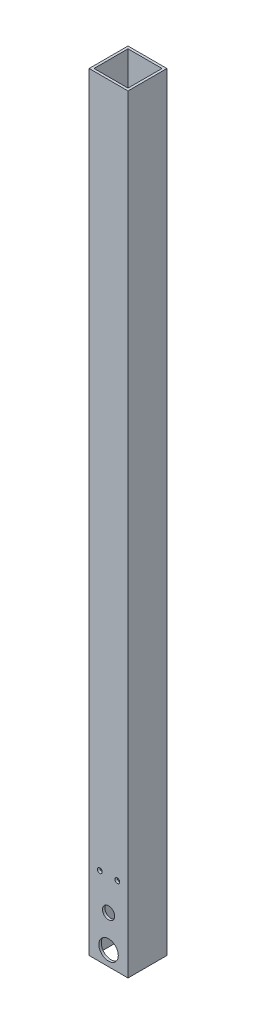
ISO-10303-21;
HEADER;
FILE_DESCRIPTION(('STEP AP214'),'2;1');
FILE_NAME('part.step','',(''),(''),'','','');
FILE_SCHEMA(('AUTOMOTIVE_DESIGN { 1 0 10303 214 1 1 1 1 }'));
ENDSEC;
DATA;
#1=APPLICATION_CONTEXT('core data for automotive mechanical design processes');
#2=APPLICATION_PROTOCOL_DEFINITION('international standard','automotive_design',2000,#1);
#3=PRODUCT_CONTEXT('',#1,'mechanical');
#4=PRODUCT('Part','Part','',(#3));
#5=PRODUCT_RELATED_PRODUCT_CATEGORY('part','',(#4));
#6=PRODUCT_DEFINITION_FORMATION('','',#4);
#7=PRODUCT_DEFINITION_CONTEXT('part definition',#1,'design');
#8=PRODUCT_DEFINITION('design','',#6,#7);
#9=PRODUCT_DEFINITION_SHAPE('','',#8);
#10=(LENGTH_UNIT() NAMED_UNIT(*) SI_UNIT(.MILLI.,.METRE.));
#11=(NAMED_UNIT(*) PLANE_ANGLE_UNIT() SI_UNIT($,.RADIAN.));
#12=(NAMED_UNIT(*) SI_UNIT($,.STERADIAN.) SOLID_ANGLE_UNIT());
#13=UNCERTAINTY_MEASURE_WITH_UNIT(LENGTH_MEASURE(1.E-05),#10,'distance_accuracy_value','');
#14=(GEOMETRIC_REPRESENTATION_CONTEXT(3) GLOBAL_UNCERTAINTY_ASSIGNED_CONTEXT((#13)) GLOBAL_UNIT_ASSIGNED_CONTEXT((#10,
#11,#12)) REPRESENTATION_CONTEXT('',''));
#15=CARTESIAN_POINT('',(0.,0.,0.));
#16=DIRECTION('',(0.,0.,1.));
#17=DIRECTION('',(1.,0.,0.));
#18=AXIS2_PLACEMENT_3D('',#15,#16,#17);
#19=CARTESIAN_POINT('',(0.,501.65,0.));
#20=DIRECTION('',(0.,1.,0.));
#21=DIRECTION('',(0.,0.,1.));
#22=AXIS2_PLACEMENT_3D('',#19,#20,#21);
#23=PLANE('',#22);
#24=DIRECTION('',(0.,0.,-1.));
#25=VECTOR('',#24,1.);
#26=CARTESIAN_POINT('',(12.7,501.65,-12.7));
#27=LINE('',#26,#25);
#28=CARTESIAN_POINT('',(12.7,501.65,12.7));
#29=VERTEX_POINT('',#28);
#30=CARTESIAN_POINT('',(12.7,501.65,-12.7));
#31=VERTEX_POINT('',#30);
#32=EDGE_CURVE('E138',#29,#31,#27,.T.);
#33=ORIENTED_EDGE('',*,*,#32,.T.);
#34=DIRECTION('',(-1.,0.,0.));
#35=VECTOR('',#34,1.);
#36=CARTESIAN_POINT('',(-12.7,501.65,-12.7));
#37=LINE('',#36,#35);
#38=CARTESIAN_POINT('',(-12.7,501.65,-12.7));
#39=VERTEX_POINT('',#38);
#40=EDGE_CURVE('E141',#31,#39,#37,.T.);
#41=ORIENTED_EDGE('',*,*,#40,.T.);
#42=DIRECTION('',(0.,0.,1.));
#43=VECTOR('',#42,1.);
#44=CARTESIAN_POINT('',(-12.7,501.65,-12.7));
#45=LINE('',#44,#43);
#46=CARTESIAN_POINT('',(-12.7,501.65,12.7));
#47=VERTEX_POINT('',#46);
#48=EDGE_CURVE('E144',#39,#47,#45,.T.);
#49=ORIENTED_EDGE('',*,*,#48,.T.);
#50=DIRECTION('',(1.,0.,0.));
#51=VECTOR('',#50,1.);
#52=CARTESIAN_POINT('',(-12.7,501.65,12.7));
#53=LINE('',#52,#51);
#54=EDGE_CURVE('E146',#47,#29,#53,.T.);
#55=ORIENTED_EDGE('',*,*,#54,.T.);
#56=EDGE_LOOP('',(#33,#41,#49,#55));
#57=FACE_BOUND('',#56,.T.);
#58=DIRECTION('',(0.,0.,1.));
#59=VECTOR('',#58,1.);
#60=CARTESIAN_POINT('',(-11.1125,501.65,-11.1125));
#61=LINE('',#60,#59);
#62=CARTESIAN_POINT('',(-11.1125,501.65,-11.1125));
#63=VERTEX_POINT('',#62);
#64=CARTESIAN_POINT('',(-11.1125,501.65,11.1125));
#65=VERTEX_POINT('',#64);
#66=EDGE_CURVE('E108',#63,#65,#61,.T.);
#67=ORIENTED_EDGE('',*,*,#66,.F.);
#68=DIRECTION('',(-1.,0.,0.));
#69=VECTOR('',#68,1.);
#70=CARTESIAN_POINT('',(-11.1125,501.65,-11.1125));
#71=LINE('',#70,#69);
#72=CARTESIAN_POINT('',(11.1125,501.65,-11.1125));
#73=VERTEX_POINT('',#72);
#74=EDGE_CURVE('E100',#73,#63,#71,.T.);
#75=ORIENTED_EDGE('',*,*,#74,.F.);
#76=DIRECTION('',(0.,0.,-1.));
#77=VECTOR('',#76,1.);
#78=CARTESIAN_POINT('',(11.1125,501.65,-11.1125));
#79=LINE('',#78,#77);
#80=CARTESIAN_POINT('',(11.1125,501.65,11.1125));
#81=VERTEX_POINT('',#80);
#82=EDGE_CURVE('E122',#81,#73,#79,.T.);
#83=ORIENTED_EDGE('',*,*,#82,.F.);
#84=DIRECTION('',(1.,0.,0.));
#85=VECTOR('',#84,1.);
#86=CARTESIAN_POINT('',(-11.1125,501.65,11.1125));
#87=LINE('',#86,#85);
#88=EDGE_CURVE('E120',#65,#81,#87,.T.);
#89=ORIENTED_EDGE('',*,*,#88,.F.);
#90=EDGE_LOOP('',(#67,#75,#83,#89));
#91=FACE_BOUND('',#90,.T.);
#92=ADVANCED_FACE('F33',(#57,#91),#23,.T.);
#93=CARTESIAN_POINT('',(0.,0.,0.));
#94=DIRECTION('',(0.,1.,0.));
#95=DIRECTION('',(0.,0.,1.));
#96=AXIS2_PLACEMENT_3D('',#93,#94,#95);
#97=PLANE('',#96);
#98=DIRECTION('',(0.,0.,-1.));
#99=VECTOR('',#98,1.);
#100=CARTESIAN_POINT('',(12.7,0.,-12.7));
#101=LINE('',#100,#99);
#102=CARTESIAN_POINT('',(12.7,0.,12.7));
#103=VERTEX_POINT('',#102);
#104=CARTESIAN_POINT('',(12.7,0.,-12.7));
#105=VERTEX_POINT('',#104);
#106=EDGE_CURVE('E116',#103,#105,#101,.T.);
#107=ORIENTED_EDGE('',*,*,#106,.F.);
#108=DIRECTION('',(1.,0.,0.));
#109=VECTOR('',#108,1.);
#110=CARTESIAN_POINT('',(-12.7,0.,12.7));
#111=LINE('',#110,#109);
#112=CARTESIAN_POINT('',(-12.7,0.,12.7));
#113=VERTEX_POINT('',#112);
#114=EDGE_CURVE('E142',#113,#103,#111,.T.);
#115=ORIENTED_EDGE('',*,*,#114,.F.);
#116=DIRECTION('',(0.,0.,1.));
#117=VECTOR('',#116,1.);
#118=CARTESIAN_POINT('',(-12.7,0.,-12.7));
#119=LINE('',#118,#117);
#120=CARTESIAN_POINT('',(-12.7,0.,-12.7));
#121=VERTEX_POINT('',#120);
#122=EDGE_CURVE('E153',#121,#113,#119,.T.);
#123=ORIENTED_EDGE('',*,*,#122,.F.);
#124=DIRECTION('',(-1.,0.,0.));
#125=VECTOR('',#124,1.);
#126=CARTESIAN_POINT('',(-12.7,0.,-12.7));
#127=LINE('',#126,#125);
#128=EDGE_CURVE('E151',#105,#121,#127,.T.);
#129=ORIENTED_EDGE('',*,*,#128,.F.);
#130=EDGE_LOOP('',(#107,#115,#123,#129));
#131=FACE_BOUND('',#130,.T.);
#132=DIRECTION('',(-1.,0.,0.));
#133=VECTOR('',#132,1.);
#134=CARTESIAN_POINT('',(-11.1125,0.,-11.1125));
#135=LINE('',#134,#133);
#136=CARTESIAN_POINT('',(11.1125,0.,-11.1125));
#137=VERTEX_POINT('',#136);
#138=CARTESIAN_POINT('',(-11.1125,0.,-11.1125));
#139=VERTEX_POINT('',#138);
#140=EDGE_CURVE('E58',#137,#139,#135,.T.);
#141=ORIENTED_EDGE('',*,*,#140,.T.);
#142=DIRECTION('',(0.,0.,1.));
#143=VECTOR('',#142,1.);
#144=CARTESIAN_POINT('',(-11.1125,0.,-11.1125));
#145=LINE('',#144,#143);
#146=CARTESIAN_POINT('',(-11.1125,0.,11.1125));
#147=VERTEX_POINT('',#146);
#148=EDGE_CURVE('E115',#139,#147,#145,.T.);
#149=ORIENTED_EDGE('',*,*,#148,.T.);
#150=DIRECTION('',(1.,0.,0.));
#151=VECTOR('',#150,1.);
#152=CARTESIAN_POINT('',(-11.1125,0.,11.1125));
#153=LINE('',#152,#151);
#154=CARTESIAN_POINT('',(11.1125,0.,11.1125));
#155=VERTEX_POINT('',#154);
#156=EDGE_CURVE('E130',#147,#155,#153,.T.);
#157=ORIENTED_EDGE('',*,*,#156,.T.);
#158=DIRECTION('',(0.,0.,-1.));
#159=VECTOR('',#158,1.);
#160=CARTESIAN_POINT('',(11.1125,0.,-11.1125));
#161=LINE('',#160,#159);
#162=EDGE_CURVE('E109',#155,#137,#161,.T.);
#163=ORIENTED_EDGE('',*,*,#162,.T.);
#164=EDGE_LOOP('',(#141,#149,#157,#163));
#165=FACE_BOUND('',#164,.T.);
#166=ADVANCED_FACE('F221',(#131,#165),#97,.F.);
#167=CARTESIAN_POINT('',(12.7,501.65,-12.7));
#168=DIRECTION('',(-1.,0.,0.));
#169=DIRECTION('',(0.,0.,1.));
#170=AXIS2_PLACEMENT_3D('',#167,#168,#169);
#171=PLANE('',#170);
#172=ORIENTED_EDGE('',*,*,#106,.T.);
#173=DIRECTION('',(0.,-1.,0.));
#174=VECTOR('',#173,1.);
#175=CARTESIAN_POINT('',(12.7,501.65,-12.7));
#176=LINE('',#175,#174);
#177=EDGE_CURVE('E11',#31,#105,#176,.T.);
#178=ORIENTED_EDGE('',*,*,#177,.F.);
#179=ORIENTED_EDGE('',*,*,#32,.F.);
#180=DIRECTION('',(0.,-1.,0.));
#181=VECTOR('',#180,1.);
#182=CARTESIAN_POINT('',(12.7,501.65,12.7));
#183=LINE('',#182,#181);
#184=EDGE_CURVE('E148',#29,#103,#183,.T.);
#185=ORIENTED_EDGE('',*,*,#184,.T.);
#186=EDGE_LOOP('',(#172,#178,#179,#185));
#187=FACE_BOUND('',#186,.T.);
#188=ADVANCED_FACE('F35',(#187),#171,.F.);
#189=CARTESIAN_POINT('',(-12.7,501.65,-12.7));
#190=DIRECTION('',(0.,0.,1.));
#191=DIRECTION('',(1.,0.,0.));
#192=AXIS2_PLACEMENT_3D('',#189,#190,#191);
#193=PLANE('',#192);
#194=CARTESIAN_POINT('',(5.70963749660649,51.517813991833,-12.7));
#195=DIRECTION('',(0.,0.,-1.));
#196=DIRECTION('',(-1.,0.,0.));
#197=AXIS2_PLACEMENT_3D('',#194,#195,#196);
#198=CIRCLE('',#197,1.5875);
#199=CARTESIAN_POINT('',(4.12213749660649,51.517813991833,-12.7));
#200=VERTEX_POINT('',#199);
#201=EDGE_CURVE('E175',#200,#200,#198,.T.);
#202=ORIENTED_EDGE('',*,*,#201,.F.);
#203=EDGE_LOOP('',(#202));
#204=FACE_BOUND('',#203,.T.);
#205=CARTESIAN_POINT('',(-5.70963749660667,51.517813991833,-12.7));
#206=DIRECTION('',(0.,0.,-1.));
#207=DIRECTION('',(-1.,0.,0.));
#208=AXIS2_PLACEMENT_3D('',#205,#206,#207);
#209=CIRCLE('',#208,1.5875);
#210=CARTESIAN_POINT('',(-7.29713749660667,51.517813991833,-12.7));
#211=VERTEX_POINT('',#210);
#212=EDGE_CURVE('E188',#211,#211,#209,.T.);
#213=ORIENTED_EDGE('',*,*,#212,.F.);
#214=EDGE_LOOP('',(#213));
#215=FACE_BOUND('',#214,.T.);
#216=CARTESIAN_POINT('',(0.,9.525,-12.7));
#217=DIRECTION('',(0.,0.,1.));
#218=DIRECTION('',(1.,0.,0.));
#219=AXIS2_PLACEMENT_3D('',#216,#217,#218);
#220=CIRCLE('',#219,6.35);
#221=CARTESIAN_POINT('',(6.35,9.525,-12.7));
#222=VERTEX_POINT('',#221);
#223=EDGE_CURVE('E165',#222,#222,#220,.T.);
#224=ORIENTED_EDGE('',*,*,#223,.T.);
#225=EDGE_LOOP('',(#224));
#226=FACE_BOUND('',#225,.T.);
#227=ORIENTED_EDGE('',*,*,#128,.T.);
#228=DIRECTION('',(0.,-1.,0.));
#229=VECTOR('',#228,1.);
#230=CARTESIAN_POINT('',(-12.7,501.65,-12.7));
#231=LINE('',#230,#229);
#232=EDGE_CURVE('E42',#39,#121,#231,.T.);
#233=ORIENTED_EDGE('',*,*,#232,.F.);
#234=ORIENTED_EDGE('',*,*,#40,.F.);
#235=ORIENTED_EDGE('',*,*,#177,.T.);
#236=EDGE_LOOP('',(#227,#233,#234,#235));
#237=FACE_BOUND('',#236,.T.);
#238=ADVANCED_FACE('F230',(#204,#215,#226,#237),#193,.F.);
#239=CARTESIAN_POINT('',(-12.7,501.65,-12.7));
#240=DIRECTION('',(1.,0.,0.));
#241=DIRECTION('',(0.,0.,-1.));
#242=AXIS2_PLACEMENT_3D('',#239,#240,#241);
#243=PLANE('',#242);
#244=ORIENTED_EDGE('',*,*,#122,.T.);
#245=DIRECTION('',(0.,-1.,0.));
#246=VECTOR('',#245,1.);
#247=CARTESIAN_POINT('',(-12.7,501.65,12.7));
#248=LINE('',#247,#246);
#249=EDGE_CURVE('E158',#47,#113,#248,.T.);
#250=ORIENTED_EDGE('',*,*,#249,.F.);
#251=ORIENTED_EDGE('',*,*,#48,.F.);
#252=ORIENTED_EDGE('',*,*,#232,.T.);
#253=EDGE_LOOP('',(#244,#250,#251,#252));
#254=FACE_BOUND('',#253,.T.);
#255=ADVANCED_FACE('F214',(#254),#243,.F.);
#256=CARTESIAN_POINT('',(-12.7,501.65,12.7));
#257=DIRECTION('',(0.,0.,-1.));
#258=DIRECTION('',(-1.,0.,0.));
#259=AXIS2_PLACEMENT_3D('',#256,#257,#258);
#260=PLANE('',#259);
#261=CARTESIAN_POINT('',(0.,30.5023011999998,12.7));
#262=DIRECTION('',(0.,0.,1.));
#263=DIRECTION('',(1.,0.,0.));
#264=AXIS2_PLACEMENT_3D('',#261,#262,#263);
#265=CIRCLE('',#264,3.96875000000002);
#266=CARTESIAN_POINT('',(3.96875000000002,30.5023011999998,12.7));
#267=VERTEX_POINT('',#266);
#268=EDGE_CURVE('E289',#267,#267,#265,.T.);
#269=ORIENTED_EDGE('',*,*,#268,.F.);
#270=EDGE_LOOP('',(#269));
#271=FACE_BOUND('',#270,.T.);
#272=CARTESIAN_POINT('',(5.70963749660649,51.517813991833,12.7));
#273=DIRECTION('',(0.,0.,-1.));
#274=DIRECTION('',(-1.,0.,0.));
#275=AXIS2_PLACEMENT_3D('',#272,#273,#274);
#276=CIRCLE('',#275,1.5875);
#277=CARTESIAN_POINT('',(4.12213749660649,51.517813991833,12.7));
#278=VERTEX_POINT('',#277);
#279=EDGE_CURVE('E169',#278,#278,#276,.T.);
#280=ORIENTED_EDGE('',*,*,#279,.T.);
#281=EDGE_LOOP('',(#280));
#282=FACE_BOUND('',#281,.T.);
#283=CARTESIAN_POINT('',(-5.70963749660667,51.517813991833,12.7));
#284=DIRECTION('',(0.,0.,-1.));
#285=DIRECTION('',(-1.,0.,0.));
#286=AXIS2_PLACEMENT_3D('',#283,#284,#285);
#287=CIRCLE('',#286,1.5875);
#288=CARTESIAN_POINT('',(-7.29713749660667,51.517813991833,12.7));
#289=VERTEX_POINT('',#288);
#290=EDGE_CURVE('E180',#289,#289,#287,.T.);
#291=ORIENTED_EDGE('',*,*,#290,.T.);
#292=EDGE_LOOP('',(#291));
#293=FACE_BOUND('',#292,.T.);
#294=CARTESIAN_POINT('',(0.,9.525,12.7));
#295=DIRECTION('',(0.,0.,1.));
#296=DIRECTION('',(1.,0.,0.));
#297=AXIS2_PLACEMENT_3D('',#294,#295,#296);
#298=CIRCLE('',#297,6.35);
#299=CARTESIAN_POINT('',(6.35,9.525,12.7));
#300=VERTEX_POINT('',#299);
#301=EDGE_CURVE('E194',#300,#300,#298,.T.);
#302=ORIENTED_EDGE('',*,*,#301,.F.);
#303=EDGE_LOOP('',(#302));
#304=FACE_BOUND('',#303,.T.);
#305=ORIENTED_EDGE('',*,*,#114,.T.);
#306=ORIENTED_EDGE('',*,*,#184,.F.);
#307=ORIENTED_EDGE('',*,*,#54,.F.);
#308=ORIENTED_EDGE('',*,*,#249,.T.);
#309=EDGE_LOOP('',(#305,#306,#307,#308));
#310=FACE_BOUND('',#309,.T.);
#311=ADVANCED_FACE('F205',(#271,#282,#293,#304,#310),#260,.F.);
#312=CARTESIAN_POINT('',(-11.1125,501.65,-11.1125));
#313=DIRECTION('',(0.,0.,1.));
#314=DIRECTION('',(1.,0.,0.));
#315=AXIS2_PLACEMENT_3D('',#312,#313,#314);
#316=PLANE('',#315);
#317=CARTESIAN_POINT('',(5.70963749660649,51.517813991833,-11.1125));
#318=DIRECTION('',(0.,0.,1.));
#319=DIRECTION('',(1.,0.,0.));
#320=AXIS2_PLACEMENT_3D('',#317,#318,#319);
#321=CIRCLE('',#320,1.5875);
#322=CARTESIAN_POINT('',(7.29713749660649,51.517813991833,-11.1125));
#323=VERTEX_POINT('',#322);
#324=EDGE_CURVE('E191',#323,#323,#321,.T.);
#325=ORIENTED_EDGE('',*,*,#324,.F.);
#326=EDGE_LOOP('',(#325));
#327=FACE_BOUND('',#326,.T.);
#328=CARTESIAN_POINT('',(-5.70963749660667,51.517813991833,-11.1125));
#329=DIRECTION('',(0.,0.,1.));
#330=DIRECTION('',(1.,0.,0.));
#331=AXIS2_PLACEMENT_3D('',#328,#329,#330);
#332=CIRCLE('',#331,1.5875);
#333=CARTESIAN_POINT('',(-4.12213749660667,51.517813991833,-11.1125));
#334=VERTEX_POINT('',#333);
#335=EDGE_CURVE('E168',#334,#334,#332,.T.);
#336=ORIENTED_EDGE('',*,*,#335,.F.);
#337=EDGE_LOOP('',(#336));
#338=FACE_BOUND('',#337,.T.);
#339=CARTESIAN_POINT('',(0.,9.525,-11.1125));
#340=DIRECTION('',(0.,0.,1.));
#341=DIRECTION('',(1.,0.,0.));
#342=AXIS2_PLACEMENT_3D('',#339,#340,#341);
#343=CIRCLE('',#342,6.35);
#344=CARTESIAN_POINT('',(6.35,9.525,-11.1125));
#345=VERTEX_POINT('',#344);
#346=EDGE_CURVE('E128',#345,#345,#343,.T.);
#347=ORIENTED_EDGE('',*,*,#346,.F.);
#348=EDGE_LOOP('',(#347));
#349=FACE_BOUND('',#348,.T.);
#350=ORIENTED_EDGE('',*,*,#140,.F.);
#351=DIRECTION('',(0.,-1.,0.));
#352=VECTOR('',#351,1.);
#353=CARTESIAN_POINT('',(11.1125,501.65,-11.1125));
#354=LINE('',#353,#352);
#355=EDGE_CURVE('E104',#73,#137,#354,.T.);
#356=ORIENTED_EDGE('',*,*,#355,.F.);
#357=ORIENTED_EDGE('',*,*,#74,.T.);
#358=DIRECTION('',(0.,-1.,0.));
#359=VECTOR('',#358,1.);
#360=CARTESIAN_POINT('',(-11.1125,501.65,-11.1125));
#361=LINE('',#360,#359);
#362=EDGE_CURVE('E103',#63,#139,#361,.T.);
#363=ORIENTED_EDGE('',*,*,#362,.T.);
#364=EDGE_LOOP('',(#350,#356,#357,#363));
#365=FACE_BOUND('',#364,.T.);
#366=ADVANCED_FACE('F102',(#327,#338,#349,#365),#316,.T.);
#367=CARTESIAN_POINT('',(-11.1125,501.65,-11.1125));
#368=DIRECTION('',(1.,0.,0.));
#369=DIRECTION('',(0.,0.,-1.));
#370=AXIS2_PLACEMENT_3D('',#367,#368,#369);
#371=PLANE('',#370);
#372=ORIENTED_EDGE('',*,*,#148,.F.);
#373=ORIENTED_EDGE('',*,*,#362,.F.);
#374=ORIENTED_EDGE('',*,*,#66,.T.);
#375=DIRECTION('',(0.,-1.,0.));
#376=VECTOR('',#375,1.);
#377=CARTESIAN_POINT('',(-11.1125,501.65,11.1125));
#378=LINE('',#377,#376);
#379=EDGE_CURVE('E117',#65,#147,#378,.T.);
#380=ORIENTED_EDGE('',*,*,#379,.T.);
#381=EDGE_LOOP('',(#372,#373,#374,#380));
#382=FACE_BOUND('',#381,.T.);
#383=ADVANCED_FACE('F112',(#382),#371,.T.);
#384=CARTESIAN_POINT('',(-11.1125,501.65,11.1125));
#385=DIRECTION('',(0.,0.,-1.));
#386=DIRECTION('',(-1.,0.,0.));
#387=AXIS2_PLACEMENT_3D('',#384,#385,#386);
#388=PLANE('',#387);
#389=CARTESIAN_POINT('',(0.,30.5023011999998,11.1125));
#390=DIRECTION('',(0.,0.,-1.));
#391=DIRECTION('',(-1.,0.,0.));
#392=AXIS2_PLACEMENT_3D('',#389,#390,#391);
#393=CIRCLE('',#392,3.96875000000002);
#394=CARTESIAN_POINT('',(-3.96875000000002,30.5023011999998,11.1125));
#395=VERTEX_POINT('',#394);
#396=EDGE_CURVE('E183',#395,#395,#393,.F.);
#397=ORIENTED_EDGE('',*,*,#396,.T.);
#398=EDGE_LOOP('',(#397));
#399=FACE_BOUND('',#398,.T.);
#400=CARTESIAN_POINT('',(5.70963749660649,51.517813991833,11.1125));
#401=DIRECTION('',(0.,0.,-1.));
#402=DIRECTION('',(-1.,0.,0.));
#403=AXIS2_PLACEMENT_3D('',#400,#401,#402);
#404=CIRCLE('',#403,1.5875);
#405=CARTESIAN_POINT('',(4.12213749660649,51.517813991833,11.1125));
#406=VERTEX_POINT('',#405);
#407=EDGE_CURVE('E37',#406,#406,#404,.T.);
#408=ORIENTED_EDGE('',*,*,#407,.F.);
#409=EDGE_LOOP('',(#408));
#410=FACE_BOUND('',#409,.T.);
#411=CARTESIAN_POINT('',(-5.70963749660667,51.517813991833,11.1125));
#412=DIRECTION('',(0.,0.,-1.));
#413=DIRECTION('',(-1.,0.,0.));
#414=AXIS2_PLACEMENT_3D('',#411,#412,#413);
#415=CIRCLE('',#414,1.5875);
#416=CARTESIAN_POINT('',(-7.29713749660667,51.517813991833,11.1125));
#417=VERTEX_POINT('',#416);
#418=EDGE_CURVE('E166',#417,#417,#415,.T.);
#419=ORIENTED_EDGE('',*,*,#418,.F.);
#420=EDGE_LOOP('',(#419));
#421=FACE_BOUND('',#420,.T.);
#422=CARTESIAN_POINT('',(0.,9.525,11.1125));
#423=DIRECTION('',(0.,0.,-1.));
#424=DIRECTION('',(-1.,0.,0.));
#425=AXIS2_PLACEMENT_3D('',#422,#423,#424);
#426=CIRCLE('',#425,6.35);
#427=CARTESIAN_POINT('',(-6.35,9.525,11.1125));
#428=VERTEX_POINT('',#427);
#429=EDGE_CURVE('E163',#428,#428,#426,.T.);
#430=ORIENTED_EDGE('',*,*,#429,.F.);
#431=EDGE_LOOP('',(#430));
#432=FACE_BOUND('',#431,.T.);
#433=ORIENTED_EDGE('',*,*,#156,.F.);
#434=ORIENTED_EDGE('',*,*,#379,.F.);
#435=ORIENTED_EDGE('',*,*,#88,.T.);
#436=DIRECTION('',(0.,-1.,0.));
#437=VECTOR('',#436,1.);
#438=CARTESIAN_POINT('',(11.1125,501.65,11.1125));
#439=LINE('',#438,#437);
#440=EDGE_CURVE('E50',#81,#155,#439,.T.);
#441=ORIENTED_EDGE('',*,*,#440,.T.);
#442=EDGE_LOOP('',(#433,#434,#435,#441));
#443=FACE_BOUND('',#442,.T.);
#444=ADVANCED_FACE('F212',(#399,#410,#421,#432,#443),#388,.T.);
#445=CARTESIAN_POINT('',(11.1125,501.65,-11.1125));
#446=DIRECTION('',(-1.,0.,0.));
#447=DIRECTION('',(0.,0.,1.));
#448=AXIS2_PLACEMENT_3D('',#445,#446,#447);
#449=PLANE('',#448);
#450=ORIENTED_EDGE('',*,*,#162,.F.);
#451=ORIENTED_EDGE('',*,*,#440,.F.);
#452=ORIENTED_EDGE('',*,*,#82,.T.);
#453=ORIENTED_EDGE('',*,*,#355,.T.);
#454=EDGE_LOOP('',(#450,#451,#452,#453));
#455=FACE_BOUND('',#454,.T.);
#456=ADVANCED_FACE('F257',(#455),#449,.T.);
#457=CARTESIAN_POINT('',(0.,9.525,-12.7));
#458=DIRECTION('',(0.,0.,1.));
#459=DIRECTION('',(1.,0.,0.));
#460=AXIS2_PLACEMENT_3D('',#457,#458,#459);
#461=CYLINDRICAL_SURFACE('',#460,6.35);
#462=ORIENTED_EDGE('',*,*,#429,.T.);
#463=EDGE_LOOP('',(#462));
#464=FACE_BOUND('',#463,.T.);
#465=ORIENTED_EDGE('',*,*,#301,.T.);
#466=EDGE_LOOP('',(#465));
#467=FACE_BOUND('',#466,.T.);
#468=ADVANCED_FACE('F259',(#464,#467),#461,.F.);
#469=ORIENTED_EDGE('',*,*,#346,.T.);
#470=EDGE_LOOP('',(#469));
#471=FACE_BOUND('',#470,.T.);
#472=ORIENTED_EDGE('',*,*,#223,.F.);
#473=EDGE_LOOP('',(#472));
#474=FACE_BOUND('',#473,.T.);
#475=ADVANCED_FACE('F201',(#471,#474),#461,.F.);
#476=CARTESIAN_POINT('',(-5.70963749660667,51.517813991833,12.7));
#477=DIRECTION('',(0.,0.,-1.));
#478=DIRECTION('',(-1.,0.,0.));
#479=AXIS2_PLACEMENT_3D('',#476,#477,#478);
#480=CYLINDRICAL_SURFACE('',#479,1.5875);
#481=ORIENTED_EDGE('',*,*,#418,.T.);
#482=EDGE_LOOP('',(#481));
#483=FACE_BOUND('',#482,.T.);
#484=ORIENTED_EDGE('',*,*,#290,.F.);
#485=EDGE_LOOP('',(#484));
#486=FACE_BOUND('',#485,.T.);
#487=ADVANCED_FACE('F270',(#483,#486),#480,.F.);
#488=CARTESIAN_POINT('',(5.70963749660649,51.517813991833,12.7));
#489=DIRECTION('',(0.,0.,-1.));
#490=DIRECTION('',(-1.,0.,0.));
#491=AXIS2_PLACEMENT_3D('',#488,#489,#490);
#492=CYLINDRICAL_SURFACE('',#491,1.5875);
#493=ORIENTED_EDGE('',*,*,#407,.T.);
#494=EDGE_LOOP('',(#493));
#495=FACE_BOUND('',#494,.T.);
#496=ORIENTED_EDGE('',*,*,#279,.F.);
#497=EDGE_LOOP('',(#496));
#498=FACE_BOUND('',#497,.T.);
#499=ADVANCED_FACE('F273',(#495,#498),#492,.F.);
#500=ORIENTED_EDGE('',*,*,#335,.T.);
#501=EDGE_LOOP('',(#500));
#502=FACE_BOUND('',#501,.T.);
#503=ORIENTED_EDGE('',*,*,#212,.T.);
#504=EDGE_LOOP('',(#503));
#505=FACE_BOUND('',#504,.T.);
#506=ADVANCED_FACE('F274',(#502,#505),#480,.F.);
#507=ORIENTED_EDGE('',*,*,#324,.T.);
#508=EDGE_LOOP('',(#507));
#509=FACE_BOUND('',#508,.T.);
#510=ORIENTED_EDGE('',*,*,#201,.T.);
#511=EDGE_LOOP('',(#510));
#512=FACE_BOUND('',#511,.T.);
#513=ADVANCED_FACE('F278',(#509,#512),#492,.F.);
#514=CARTESIAN_POINT('',(0.,30.5023011999998,-0.1128201513365));
#515=DIRECTION('',(0.,0.,1.));
#516=DIRECTION('',(1.,0.,0.));
#517=AXIS2_PLACEMENT_3D('',#514,#515,#516);
#518=CYLINDRICAL_SURFACE('',#517,3.96875000000002);
#519=ORIENTED_EDGE('',*,*,#268,.T.);
#520=EDGE_LOOP('',(#519));
#521=FACE_BOUND('',#520,.T.);
#522=ORIENTED_EDGE('',*,*,#396,.F.);
#523=EDGE_LOOP('',(#522));
#524=FACE_BOUND('',#523,.T.);
#525=ADVANCED_FACE('F279',(#521,#524),#518,.F.);
#526=CLOSED_SHELL('',(#92,#166,#188,#238,#255,#311,#366,#383,#444,#456,#468,#475,#487,#499,#506,
#513,#525));
#527=MANIFOLD_SOLID_BREP('B2',#526);
#528=ADVANCED_BREP_SHAPE_REPRESENTATION('',(#18,#527),#14);
#529=SHAPE_DEFINITION_REPRESENTATION(#9,#528);
ENDSEC;
END-ISO-10303-21;
